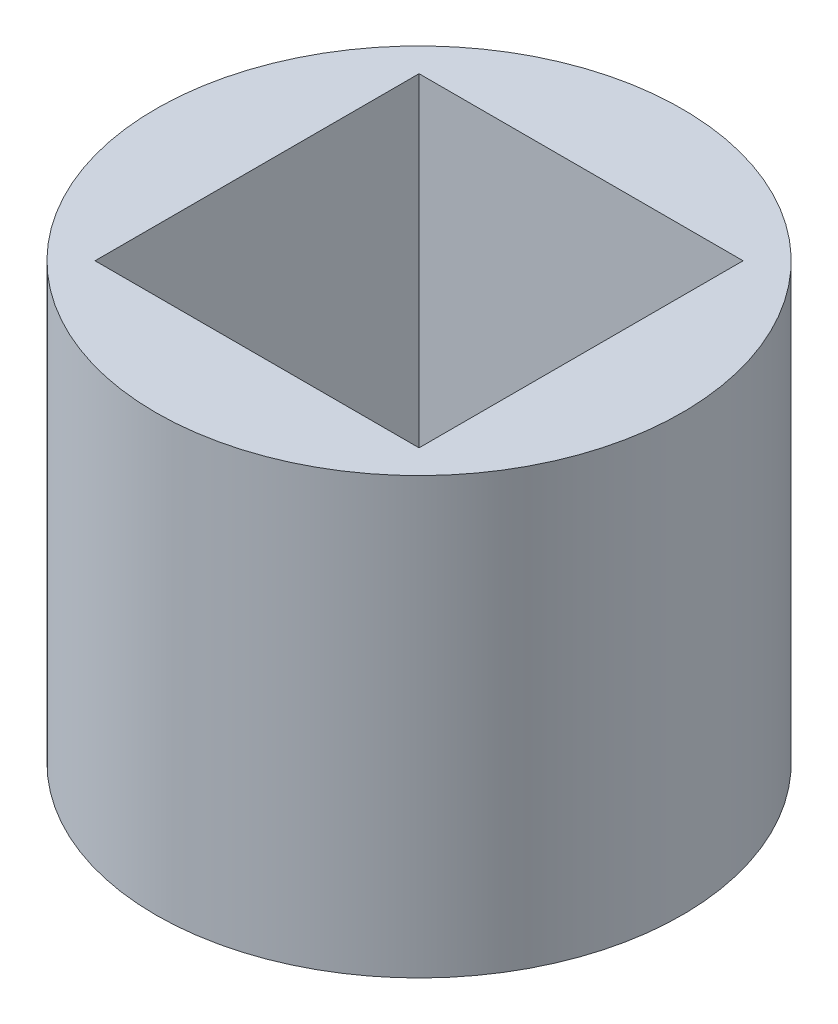
ISO-10303-21;
HEADER;
FILE_DESCRIPTION(('STEP AP214'),'2;1');
FILE_NAME('part.step','',(''),(''),'','','');
FILE_SCHEMA(('AUTOMOTIVE_DESIGN { 1 0 10303 214 1 1 1 1 }'));
ENDSEC;
DATA;
#1=APPLICATION_CONTEXT('core data for automotive mechanical design processes');
#2=APPLICATION_PROTOCOL_DEFINITION('international standard','automotive_design',2000,#1);
#3=PRODUCT_CONTEXT('',#1,'mechanical');
#4=PRODUCT('Part','Part','',(#3));
#5=PRODUCT_RELATED_PRODUCT_CATEGORY('part','',(#4));
#6=PRODUCT_DEFINITION_FORMATION('','',#4);
#7=PRODUCT_DEFINITION_CONTEXT('part definition',#1,'design');
#8=PRODUCT_DEFINITION('design','',#6,#7);
#9=PRODUCT_DEFINITION_SHAPE('','',#8);
#10=(LENGTH_UNIT() NAMED_UNIT(*) SI_UNIT(.MILLI.,.METRE.));
#11=(NAMED_UNIT(*) PLANE_ANGLE_UNIT() SI_UNIT($,.RADIAN.));
#12=(NAMED_UNIT(*) SI_UNIT($,.STERADIAN.) SOLID_ANGLE_UNIT());
#13=UNCERTAINTY_MEASURE_WITH_UNIT(LENGTH_MEASURE(1.E-05),#10,'distance_accuracy_value','');
#14=(GEOMETRIC_REPRESENTATION_CONTEXT(3) GLOBAL_UNCERTAINTY_ASSIGNED_CONTEXT((#13)) GLOBAL_UNIT_ASSIGNED_CONTEXT((#10,
#11,#12)) REPRESENTATION_CONTEXT('',''));
#15=CARTESIAN_POINT('',(0.,0.,0.));
#16=DIRECTION('',(0.,0.,1.));
#17=DIRECTION('',(1.,0.,0.));
#18=AXIS2_PLACEMENT_3D('',#15,#16,#17);
#19=CARTESIAN_POINT('',(0.,21.,0.));
#20=DIRECTION('',(0.,1.,0.));
#21=DIRECTION('',(0.,0.,1.));
#22=AXIS2_PLACEMENT_3D('',#19,#20,#21);
#23=PLANE('',#22);
#24=CARTESIAN_POINT('',(0.,21.,0.));
#25=DIRECTION('',(0.,1.,0.));
#26=DIRECTION('',(0.,0.,1.));
#27=AXIS2_PLACEMENT_3D('',#24,#25,#26);
#28=CIRCLE('',#27,12.7);
#29=CARTESIAN_POINT('',(0.,21.,12.7));
#30=VERTEX_POINT('',#29);
#31=EDGE_CURVE('E11',#30,#30,#28,.T.);
#32=ORIENTED_EDGE('',*,*,#31,.T.);
#33=EDGE_LOOP('',(#32));
#34=FACE_BOUND('',#33,.T.);
#35=DIRECTION('',(-1.,0.,0.));
#36=VECTOR('',#35,1.);
#37=CARTESIAN_POINT('',(-7.82,21.,-7.82));
#38=LINE('',#37,#36);
#39=CARTESIAN_POINT('',(7.82,21.,-7.82));
#40=VERTEX_POINT('',#39);
#41=CARTESIAN_POINT('',(-7.82,21.,-7.82));
#42=VERTEX_POINT('',#41);
#43=EDGE_CURVE('E90',#40,#42,#38,.T.);
#44=ORIENTED_EDGE('',*,*,#43,.F.);
#45=DIRECTION('',(0.,0.,-1.));
#46=VECTOR('',#45,1.);
#47=CARTESIAN_POINT('',(7.82,21.,-7.82));
#48=LINE('',#47,#46);
#49=CARTESIAN_POINT('',(7.82,21.,7.82));
#50=VERTEX_POINT('',#49);
#51=EDGE_CURVE('E81',#50,#40,#48,.T.);
#52=ORIENTED_EDGE('',*,*,#51,.F.);
#53=DIRECTION('',(1.,0.,0.));
#54=VECTOR('',#53,1.);
#55=CARTESIAN_POINT('',(-7.82,21.,7.82));
#56=LINE('',#55,#54);
#57=CARTESIAN_POINT('',(-7.82,21.,7.82));
#58=VERTEX_POINT('',#57);
#59=EDGE_CURVE('E106',#58,#50,#56,.T.);
#60=ORIENTED_EDGE('',*,*,#59,.F.);
#61=DIRECTION('',(0.,0.,1.));
#62=VECTOR('',#61,1.);
#63=CARTESIAN_POINT('',(-7.82,21.,-7.82));
#64=LINE('',#63,#62);
#65=EDGE_CURVE('E102',#42,#58,#64,.T.);
#66=ORIENTED_EDGE('',*,*,#65,.F.);
#67=EDGE_LOOP('',(#44,#52,#60,#66));
#68=FACE_BOUND('',#67,.T.);
#69=ADVANCED_FACE('F39',(#34,#68),#23,.T.);
#70=CARTESIAN_POINT('',(0.,0.,0.));
#71=DIRECTION('',(0.,1.,0.));
#72=DIRECTION('',(0.,0.,1.));
#73=AXIS2_PLACEMENT_3D('',#70,#71,#72);
#74=PLANE('',#73);
#75=CARTESIAN_POINT('',(0.,0.,0.));
#76=DIRECTION('',(0.,1.,0.));
#77=DIRECTION('',(0.,0.,1.));
#78=AXIS2_PLACEMENT_3D('',#75,#76,#77);
#79=CIRCLE('',#78,12.7);
#80=CARTESIAN_POINT('',(0.,0.,12.7));
#81=VERTEX_POINT('',#80);
#82=EDGE_CURVE('E43',#81,#81,#79,.T.);
#83=ORIENTED_EDGE('',*,*,#82,.F.);
#84=EDGE_LOOP('',(#83));
#85=FACE_BOUND('',#84,.T.);
#86=DIRECTION('',(0.,0.,-1.));
#87=VECTOR('',#86,1.);
#88=CARTESIAN_POINT('',(7.82,0.,-7.82));
#89=LINE('',#88,#87);
#90=CARTESIAN_POINT('',(7.82,0.,7.82));
#91=VERTEX_POINT('',#90);
#92=CARTESIAN_POINT('',(7.82,0.,-7.82));
#93=VERTEX_POINT('',#92);
#94=EDGE_CURVE('E63',#91,#93,#89,.T.);
#95=ORIENTED_EDGE('',*,*,#94,.T.);
#96=DIRECTION('',(-1.,0.,0.));
#97=VECTOR('',#96,1.);
#98=CARTESIAN_POINT('',(-7.82,0.,-7.82));
#99=LINE('',#98,#97);
#100=CARTESIAN_POINT('',(-7.82,0.,-7.82));
#101=VERTEX_POINT('',#100);
#102=EDGE_CURVE('E97',#93,#101,#99,.T.);
#103=ORIENTED_EDGE('',*,*,#102,.T.);
#104=DIRECTION('',(0.,0.,1.));
#105=VECTOR('',#104,1.);
#106=CARTESIAN_POINT('',(-7.82,0.,-7.82));
#107=LINE('',#106,#105);
#108=CARTESIAN_POINT('',(-7.82,0.,7.82));
#109=VERTEX_POINT('',#108);
#110=EDGE_CURVE('E115',#101,#109,#107,.T.);
#111=ORIENTED_EDGE('',*,*,#110,.T.);
#112=DIRECTION('',(1.,0.,0.));
#113=VECTOR('',#112,1.);
#114=CARTESIAN_POINT('',(-7.82,0.,7.82));
#115=LINE('',#114,#113);
#116=EDGE_CURVE('E91',#109,#91,#115,.T.);
#117=ORIENTED_EDGE('',*,*,#116,.T.);
#118=EDGE_LOOP('',(#95,#103,#111,#117));
#119=FACE_BOUND('',#118,.T.);
#120=ADVANCED_FACE('F131',(#85,#119),#74,.F.);
#121=CARTESIAN_POINT('',(0.,21.,0.));
#122=DIRECTION('',(0.,-1.,0.));
#123=DIRECTION('',(0.,0.,-1.));
#124=AXIS2_PLACEMENT_3D('',#121,#122,#123);
#125=CYLINDRICAL_SURFACE('',#124,12.7);
#126=ORIENTED_EDGE('',*,*,#31,.F.);
#127=EDGE_LOOP('',(#126));
#128=FACE_BOUND('',#127,.T.);
#129=ORIENTED_EDGE('',*,*,#82,.T.);
#130=EDGE_LOOP('',(#129));
#131=FACE_BOUND('',#130,.T.);
#132=ADVANCED_FACE('F41',(#128,#131),#125,.T.);
#133=CARTESIAN_POINT('',(7.82,21.,-7.82));
#134=DIRECTION('',(-1.,0.,0.));
#135=DIRECTION('',(0.,0.,1.));
#136=AXIS2_PLACEMENT_3D('',#133,#134,#135);
#137=PLANE('',#136);
#138=ORIENTED_EDGE('',*,*,#94,.F.);
#139=DIRECTION('',(0.,-1.,0.));
#140=VECTOR('',#139,1.);
#141=CARTESIAN_POINT('',(7.82,21.,7.82));
#142=LINE('',#141,#140);
#143=EDGE_CURVE('E85',#50,#91,#142,.T.);
#144=ORIENTED_EDGE('',*,*,#143,.F.);
#145=ORIENTED_EDGE('',*,*,#51,.T.);
#146=DIRECTION('',(0.,-1.,0.));
#147=VECTOR('',#146,1.);
#148=CARTESIAN_POINT('',(7.82,21.,-7.82));
#149=LINE('',#148,#147);
#150=EDGE_CURVE('E84',#40,#93,#149,.T.);
#151=ORIENTED_EDGE('',*,*,#150,.T.);
#152=EDGE_LOOP('',(#138,#144,#145,#151));
#153=FACE_BOUND('',#152,.T.);
#154=ADVANCED_FACE('F83',(#153),#137,.T.);
#155=CARTESIAN_POINT('',(-7.82,21.,-7.82));
#156=DIRECTION('',(0.,0.,1.));
#157=DIRECTION('',(1.,0.,0.));
#158=AXIS2_PLACEMENT_3D('',#155,#156,#157);
#159=PLANE('',#158);
#160=ORIENTED_EDGE('',*,*,#102,.F.);
#161=ORIENTED_EDGE('',*,*,#150,.F.);
#162=ORIENTED_EDGE('',*,*,#43,.T.);
#163=DIRECTION('',(0.,-1.,0.));
#164=VECTOR('',#163,1.);
#165=CARTESIAN_POINT('',(-7.82,21.,-7.82));
#166=LINE('',#165,#164);
#167=EDGE_CURVE('E99',#42,#101,#166,.T.);
#168=ORIENTED_EDGE('',*,*,#167,.T.);
#169=EDGE_LOOP('',(#160,#161,#162,#168));
#170=FACE_BOUND('',#169,.T.);
#171=ADVANCED_FACE('F94',(#170),#159,.T.);
#172=CARTESIAN_POINT('',(-7.82,21.,-7.82));
#173=DIRECTION('',(1.,0.,0.));
#174=DIRECTION('',(0.,0.,-1.));
#175=AXIS2_PLACEMENT_3D('',#172,#173,#174);
#176=PLANE('',#175);
#177=ORIENTED_EDGE('',*,*,#110,.F.);
#178=ORIENTED_EDGE('',*,*,#167,.F.);
#179=ORIENTED_EDGE('',*,*,#65,.T.);
#180=DIRECTION('',(0.,-1.,0.));
#181=VECTOR('',#180,1.);
#182=CARTESIAN_POINT('',(-7.82,21.,7.82));
#183=LINE('',#182,#181);
#184=EDGE_CURVE('E55',#58,#109,#183,.T.);
#185=ORIENTED_EDGE('',*,*,#184,.T.);
#186=EDGE_LOOP('',(#177,#178,#179,#185));
#187=FACE_BOUND('',#186,.T.);
#188=ADVANCED_FACE('F129',(#187),#176,.T.);
#189=CARTESIAN_POINT('',(-7.82,21.,7.82));
#190=DIRECTION('',(0.,0.,-1.));
#191=DIRECTION('',(-1.,0.,0.));
#192=AXIS2_PLACEMENT_3D('',#189,#190,#191);
#193=PLANE('',#192);
#194=ORIENTED_EDGE('',*,*,#116,.F.);
#195=ORIENTED_EDGE('',*,*,#184,.F.);
#196=ORIENTED_EDGE('',*,*,#59,.T.);
#197=ORIENTED_EDGE('',*,*,#143,.T.);
#198=EDGE_LOOP('',(#194,#195,#196,#197));
#199=FACE_BOUND('',#198,.T.);
#200=ADVANCED_FACE('F132',(#199),#193,.T.);
#201=CLOSED_SHELL('',(#69,#120,#132,#154,#171,#188,#200));
#202=MANIFOLD_SOLID_BREP('B2',#201);
#203=ADVANCED_BREP_SHAPE_REPRESENTATION('',(#18,#202),#14);
#204=SHAPE_DEFINITION_REPRESENTATION(#9,#203);
ENDSEC;
END-ISO-10303-21;
